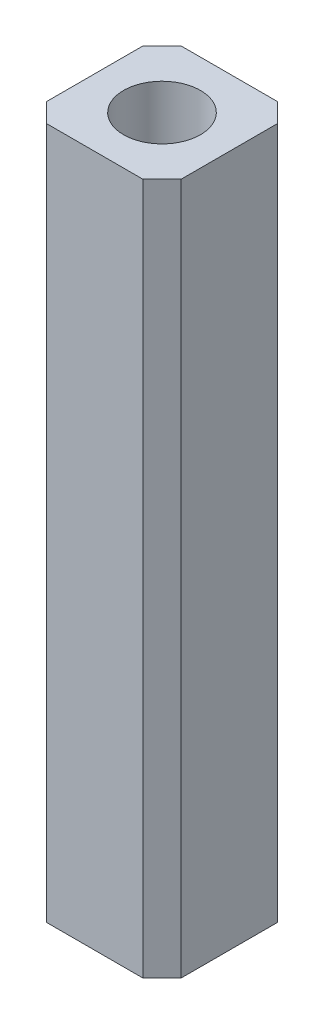
ISO-10303-21;
HEADER;
FILE_DESCRIPTION(('STEP AP214'),'2;1');
FILE_NAME('part.step','',(''),(''),'','','');
FILE_SCHEMA(('AUTOMOTIVE_DESIGN { 1 0 10303 214 1 1 1 1 }'));
ENDSEC;
DATA;
#1=APPLICATION_CONTEXT('core data for automotive mechanical design processes');
#2=APPLICATION_PROTOCOL_DEFINITION('international standard','automotive_design',2000,#1);
#3=PRODUCT_CONTEXT('',#1,'mechanical');
#4=PRODUCT('Part','Part','',(#3));
#5=PRODUCT_RELATED_PRODUCT_CATEGORY('part','',(#4));
#6=PRODUCT_DEFINITION_FORMATION('','',#4);
#7=PRODUCT_DEFINITION_CONTEXT('part definition',#1,'design');
#8=PRODUCT_DEFINITION('design','',#6,#7);
#9=PRODUCT_DEFINITION_SHAPE('','',#8);
#10=(LENGTH_UNIT() NAMED_UNIT(*) SI_UNIT(.MILLI.,.METRE.));
#11=(NAMED_UNIT(*) PLANE_ANGLE_UNIT() SI_UNIT($,.RADIAN.));
#12=(NAMED_UNIT(*) SI_UNIT($,.STERADIAN.) SOLID_ANGLE_UNIT());
#13=UNCERTAINTY_MEASURE_WITH_UNIT(LENGTH_MEASURE(1.E-05),#10,'distance_accuracy_value','');
#14=(GEOMETRIC_REPRESENTATION_CONTEXT(3) GLOBAL_UNCERTAINTY_ASSIGNED_CONTEXT((#13)) GLOBAL_UNIT_ASSIGNED_CONTEXT((#10,
#11,#12)) REPRESENTATION_CONTEXT('',''));
#15=CARTESIAN_POINT('',(0.,0.,0.));
#16=DIRECTION('',(0.,0.,1.));
#17=DIRECTION('',(1.,0.,0.));
#18=AXIS2_PLACEMENT_3D('',#15,#16,#17);
#19=CARTESIAN_POINT('',(0.,18.,0.));
#20=DIRECTION('',(0.,-1.,0.));
#21=DIRECTION('',(0.,0.,-1.));
#22=AXIS2_PLACEMENT_3D('',#19,#20,#21);
#23=PLANE('',#22);
#24=DIRECTION('',(0.,0.,-1.));
#25=VECTOR('',#24,1.);
#26=CARTESIAN_POINT('',(1.75,18.,1.75));
#27=LINE('',#26,#25);
#28=CARTESIAN_POINT('',(1.75,18.,1.25));
#29=VERTEX_POINT('',#28);
#30=CARTESIAN_POINT('',(1.75,18.,-1.25));
#31=VERTEX_POINT('',#30);
#32=EDGE_CURVE('E156',#29,#31,#27,.T.);
#33=ORIENTED_EDGE('',*,*,#32,.T.);
#34=DIRECTION('',(0.707106781186548,0.,0.707106781186548));
#35=VECTOR('',#34,1.);
#36=CARTESIAN_POINT('',(1.25,18.,-1.75));
#37=LINE('',#36,#35);
#38=CARTESIAN_POINT('',(1.25,18.,-1.75));
#39=VERTEX_POINT('',#38);
#40=EDGE_CURVE('E180',#31,#39,#37,.F.);
#41=ORIENTED_EDGE('',*,*,#40,.T.);
#42=DIRECTION('',(-1.,0.,0.));
#43=VECTOR('',#42,1.);
#44=CARTESIAN_POINT('',(-1.75,18.,-1.75));
#45=LINE('',#44,#43);
#46=CARTESIAN_POINT('',(-1.25,18.,-1.75));
#47=VERTEX_POINT('',#46);
#48=EDGE_CURVE('E133',#39,#47,#45,.T.);
#49=ORIENTED_EDGE('',*,*,#48,.T.);
#50=DIRECTION('',(0.707106781186548,0.,-0.707106781186548));
#51=VECTOR('',#50,1.);
#52=CARTESIAN_POINT('',(-1.75,18.,-1.25));
#53=LINE('',#52,#51);
#54=CARTESIAN_POINT('',(-1.75,18.,-1.25));
#55=VERTEX_POINT('',#54);
#56=EDGE_CURVE('E177',#47,#55,#53,.F.);
#57=ORIENTED_EDGE('',*,*,#56,.T.);
#58=DIRECTION('',(0.,0.,1.));
#59=VECTOR('',#58,1.);
#60=CARTESIAN_POINT('',(-1.75,18.,1.75));
#61=LINE('',#60,#59);
#62=CARTESIAN_POINT('',(-1.75,18.,1.25));
#63=VERTEX_POINT('',#62);
#64=EDGE_CURVE('E206',#55,#63,#61,.T.);
#65=ORIENTED_EDGE('',*,*,#64,.T.);
#66=DIRECTION('',(-0.707106781186548,0.,-0.707106781186548));
#67=VECTOR('',#66,1.);
#68=CARTESIAN_POINT('',(-1.25,18.,1.75));
#69=LINE('',#68,#67);
#70=CARTESIAN_POINT('',(-1.25,18.,1.75));
#71=VERTEX_POINT('',#70);
#72=EDGE_CURVE('E67',#63,#71,#69,.F.);
#73=ORIENTED_EDGE('',*,*,#72,.T.);
#74=DIRECTION('',(1.,0.,0.));
#75=VECTOR('',#74,1.);
#76=CARTESIAN_POINT('',(-1.75,18.,1.75));
#77=LINE('',#76,#75);
#78=CARTESIAN_POINT('',(1.25,18.,1.75));
#79=VERTEX_POINT('',#78);
#80=EDGE_CURVE('E158',#71,#79,#77,.T.);
#81=ORIENTED_EDGE('',*,*,#80,.T.);
#82=DIRECTION('',(-0.707106781186548,0.,0.707106781186548));
#83=VECTOR('',#82,1.);
#84=CARTESIAN_POINT('',(1.75,18.,1.25));
#85=LINE('',#84,#83);
#86=EDGE_CURVE('E174',#79,#29,#85,.F.);
#87=ORIENTED_EDGE('',*,*,#86,.T.);
#88=EDGE_LOOP('',(#33,#41,#49,#57,#65,#73,#81,#87));
#89=FACE_BOUND('',#88,.T.);
#90=CARTESIAN_POINT('',(0.,18.,0.));
#91=DIRECTION('',(0.,1.,0.));
#92=DIRECTION('',(0.,0.,1.));
#93=AXIS2_PLACEMENT_3D('',#90,#91,#92);
#94=CIRCLE('',#93,1.);
#95=CARTESIAN_POINT('',(0.,18.,1.));
#96=VERTEX_POINT('',#95);
#97=EDGE_CURVE('E150',#96,#96,#94,.T.);
#98=ORIENTED_EDGE('',*,*,#97,.F.);
#99=EDGE_LOOP('',(#98));
#100=FACE_BOUND('',#99,.T.);
#101=ADVANCED_FACE('F45',(#89,#100),#23,.F.);
#102=CARTESIAN_POINT('',(0.,0.,0.));
#103=DIRECTION('',(0.,-1.,0.));
#104=DIRECTION('',(0.,0.,-1.));
#105=AXIS2_PLACEMENT_3D('',#102,#103,#104);
#106=PLANE('',#105);
#107=DIRECTION('',(-1.,0.,0.));
#108=VECTOR('',#107,1.);
#109=CARTESIAN_POINT('',(-1.75,0.,-1.75));
#110=LINE('',#109,#108);
#111=CARTESIAN_POINT('',(1.25,0.,-1.75));
#112=VERTEX_POINT('',#111);
#113=CARTESIAN_POINT('',(-1.25,0.,-1.75));
#114=VERTEX_POINT('',#113);
#115=EDGE_CURVE('E130',#112,#114,#110,.T.);
#116=ORIENTED_EDGE('',*,*,#115,.F.);
#117=DIRECTION('',(-0.707106781186548,0.,-0.707106781186548));
#118=VECTOR('',#117,1.);
#119=CARTESIAN_POINT('',(1.5,0.,-1.5));
#120=LINE('',#119,#118);
#121=CARTESIAN_POINT('',(1.75,0.,-1.25));
#122=VERTEX_POINT('',#121);
#123=EDGE_CURVE('E112',#112,#122,#120,.F.);
#124=ORIENTED_EDGE('',*,*,#123,.T.);
#125=DIRECTION('',(0.,0.,-1.));
#126=VECTOR('',#125,1.);
#127=CARTESIAN_POINT('',(1.75,0.,1.75));
#128=LINE('',#127,#126);
#129=CARTESIAN_POINT('',(1.75,0.,1.25));
#130=VERTEX_POINT('',#129);
#131=EDGE_CURVE('E143',#130,#122,#128,.T.);
#132=ORIENTED_EDGE('',*,*,#131,.F.);
#133=DIRECTION('',(0.707106781186548,0.,-0.707106781186548));
#134=VECTOR('',#133,1.);
#135=CARTESIAN_POINT('',(1.5,0.,1.5));
#136=LINE('',#135,#134);
#137=CARTESIAN_POINT('',(1.25,0.,1.75));
#138=VERTEX_POINT('',#137);
#139=EDGE_CURVE('E162',#130,#138,#136,.F.);
#140=ORIENTED_EDGE('',*,*,#139,.T.);
#141=DIRECTION('',(1.,0.,0.));
#142=VECTOR('',#141,1.);
#143=CARTESIAN_POINT('',(-1.75,0.,1.75));
#144=LINE('',#143,#142);
#145=CARTESIAN_POINT('',(-1.25,0.,1.75));
#146=VERTEX_POINT('',#145);
#147=EDGE_CURVE('E148',#146,#138,#144,.T.);
#148=ORIENTED_EDGE('',*,*,#147,.F.);
#149=DIRECTION('',(0.707106781186548,0.,0.707106781186548));
#150=VECTOR('',#149,1.);
#151=CARTESIAN_POINT('',(-1.5,0.,1.5));
#152=LINE('',#151,#150);
#153=CARTESIAN_POINT('',(-1.75,0.,1.25));
#154=VERTEX_POINT('',#153);
#155=EDGE_CURVE('E135',#146,#154,#152,.F.);
#156=ORIENTED_EDGE('',*,*,#155,.T.);
#157=DIRECTION('',(0.,0.,1.));
#158=VECTOR('',#157,1.);
#159=CARTESIAN_POINT('',(-1.75,0.,1.75));
#160=LINE('',#159,#158);
#161=CARTESIAN_POINT('',(-1.75,0.,-1.25));
#162=VERTEX_POINT('',#161);
#163=EDGE_CURVE('E142',#162,#154,#160,.T.);
#164=ORIENTED_EDGE('',*,*,#163,.F.);
#165=DIRECTION('',(-0.707106781186548,0.,0.707106781186548));
#166=VECTOR('',#165,1.);
#167=CARTESIAN_POINT('',(-1.5,0.,-1.5));
#168=LINE('',#167,#166);
#169=EDGE_CURVE('E124',#162,#114,#168,.F.);
#170=ORIENTED_EDGE('',*,*,#169,.T.);
#171=EDGE_LOOP('',(#116,#124,#132,#140,#148,#156,#164,#170));
#172=FACE_BOUND('',#171,.T.);
#173=CARTESIAN_POINT('',(0.,0.,0.));
#174=DIRECTION('',(0.,1.,0.));
#175=DIRECTION('',(0.,0.,1.));
#176=AXIS2_PLACEMENT_3D('',#173,#174,#175);
#177=CIRCLE('',#176,1.);
#178=CARTESIAN_POINT('',(0.,0.,1.));
#179=VERTEX_POINT('',#178);
#180=EDGE_CURVE('E209',#179,#179,#177,.T.);
#181=ORIENTED_EDGE('',*,*,#180,.T.);
#182=EDGE_LOOP('',(#181));
#183=FACE_BOUND('',#182,.T.);
#184=ADVANCED_FACE('F138',(#172,#183),#106,.T.);
#185=CARTESIAN_POINT('',(1.75,18.,1.75));
#186=DIRECTION('',(-1.,0.,0.));
#187=DIRECTION('',(0.,0.,1.));
#188=AXIS2_PLACEMENT_3D('',#185,#186,#187);
#189=PLANE('',#188);
#190=ORIENTED_EDGE('',*,*,#131,.T.);
#191=DIRECTION('',(0.,1.,0.));
#192=VECTOR('',#191,1.);
#193=CARTESIAN_POINT('',(1.75,18.,-1.25));
#194=LINE('',#193,#192);
#195=EDGE_CURVE('E117',#122,#31,#194,.T.);
#196=ORIENTED_EDGE('',*,*,#195,.T.);
#197=ORIENTED_EDGE('',*,*,#32,.F.);
#198=DIRECTION('',(0.,-1.,0.));
#199=VECTOR('',#198,1.);
#200=CARTESIAN_POINT('',(1.75,18.,1.25));
#201=LINE('',#200,#199);
#202=EDGE_CURVE('E123',#29,#130,#201,.T.);
#203=ORIENTED_EDGE('',*,*,#202,.T.);
#204=EDGE_LOOP('',(#190,#196,#197,#203));
#205=FACE_BOUND('',#204,.T.);
#206=ADVANCED_FACE('F201',(#205),#189,.F.);
#207=CARTESIAN_POINT('',(-1.75,18.,-1.75));
#208=DIRECTION('',(0.,0.,1.));
#209=DIRECTION('',(1.,0.,0.));
#210=AXIS2_PLACEMENT_3D('',#207,#208,#209);
#211=PLANE('',#210);
#212=ORIENTED_EDGE('',*,*,#48,.F.);
#213=DIRECTION('',(0.,-1.,0.));
#214=VECTOR('',#213,1.);
#215=CARTESIAN_POINT('',(1.25,18.,-1.75));
#216=LINE('',#215,#214);
#217=EDGE_CURVE('E116',#39,#112,#216,.T.);
#218=ORIENTED_EDGE('',*,*,#217,.T.);
#219=ORIENTED_EDGE('',*,*,#115,.T.);
#220=DIRECTION('',(0.,1.,0.));
#221=VECTOR('',#220,1.);
#222=CARTESIAN_POINT('',(-1.25,18.,-1.75));
#223=LINE('',#222,#221);
#224=EDGE_CURVE('E136',#114,#47,#223,.T.);
#225=ORIENTED_EDGE('',*,*,#224,.T.);
#226=EDGE_LOOP('',(#212,#218,#219,#225));
#227=FACE_BOUND('',#226,.T.);
#228=ADVANCED_FACE('F129',(#227),#211,.F.);
#229=CARTESIAN_POINT('',(-1.75,18.,1.75));
#230=DIRECTION('',(1.,0.,0.));
#231=DIRECTION('',(0.,0.,-1.));
#232=AXIS2_PLACEMENT_3D('',#229,#230,#231);
#233=PLANE('',#232);
#234=ORIENTED_EDGE('',*,*,#64,.F.);
#235=DIRECTION('',(0.,-1.,0.));
#236=VECTOR('',#235,1.);
#237=CARTESIAN_POINT('',(-1.75,18.,-1.25));
#238=LINE('',#237,#236);
#239=EDGE_CURVE('E186',#55,#162,#238,.T.);
#240=ORIENTED_EDGE('',*,*,#239,.T.);
#241=ORIENTED_EDGE('',*,*,#163,.T.);
#242=DIRECTION('',(0.,1.,0.));
#243=VECTOR('',#242,1.);
#244=CARTESIAN_POINT('',(-1.75,18.,1.25));
#245=LINE('',#244,#243);
#246=EDGE_CURVE('E183',#154,#63,#245,.T.);
#247=ORIENTED_EDGE('',*,*,#246,.T.);
#248=EDGE_LOOP('',(#234,#240,#241,#247));
#249=FACE_BOUND('',#248,.T.);
#250=ADVANCED_FACE('F234',(#249),#233,.F.);
#251=CARTESIAN_POINT('',(-1.75,18.,1.75));
#252=DIRECTION('',(0.,0.,-1.));
#253=DIRECTION('',(-1.,0.,0.));
#254=AXIS2_PLACEMENT_3D('',#251,#252,#253);
#255=PLANE('',#254);
#256=ORIENTED_EDGE('',*,*,#147,.T.);
#257=DIRECTION('',(0.,1.,0.));
#258=VECTOR('',#257,1.);
#259=CARTESIAN_POINT('',(1.25,18.,1.75));
#260=LINE('',#259,#258);
#261=EDGE_CURVE('E11',#138,#79,#260,.T.);
#262=ORIENTED_EDGE('',*,*,#261,.T.);
#263=ORIENTED_EDGE('',*,*,#80,.F.);
#264=DIRECTION('',(0.,-1.,0.));
#265=VECTOR('',#264,1.);
#266=CARTESIAN_POINT('',(-1.25,18.,1.75));
#267=LINE('',#266,#265);
#268=EDGE_CURVE('E55',#71,#146,#267,.T.);
#269=ORIENTED_EDGE('',*,*,#268,.T.);
#270=EDGE_LOOP('',(#256,#262,#263,#269));
#271=FACE_BOUND('',#270,.T.);
#272=ADVANCED_FACE('F193',(#271),#255,.F.);
#273=CARTESIAN_POINT('',(0.,18.,0.));
#274=DIRECTION('',(0.,-1.,0.));
#275=DIRECTION('',(0.,0.,-1.));
#276=AXIS2_PLACEMENT_3D('',#273,#274,#275);
#277=CYLINDRICAL_SURFACE('',#276,1.);
#278=ORIENTED_EDGE('',*,*,#97,.T.);
#279=EDGE_LOOP('',(#278));
#280=FACE_BOUND('',#279,.T.);
#281=ORIENTED_EDGE('',*,*,#180,.F.);
#282=EDGE_LOOP('',(#281));
#283=FACE_BOUND('',#282,.T.);
#284=ADVANCED_FACE('F225',(#280,#283),#277,.F.);
#285=CARTESIAN_POINT('',(1.25,18.,-1.75));
#286=DIRECTION('',(-0.707106781186547,0.,0.707106781186547));
#287=DIRECTION('',(0.,-1.,0.));
#288=AXIS2_PLACEMENT_3D('',#285,#286,#287);
#289=PLANE('',#288);
#290=ORIENTED_EDGE('',*,*,#40,.F.);
#291=ORIENTED_EDGE('',*,*,#195,.F.);
#292=ORIENTED_EDGE('',*,*,#123,.F.);
#293=ORIENTED_EDGE('',*,*,#217,.F.);
#294=EDGE_LOOP('',(#290,#291,#292,#293));
#295=FACE_BOUND('',#294,.T.);
#296=ADVANCED_FACE('F115',(#295),#289,.F.);
#297=CARTESIAN_POINT('',(-1.75,18.,-1.25));
#298=DIRECTION('',(0.707106781186547,0.,0.707106781186547));
#299=DIRECTION('',(0.,-1.,0.));
#300=AXIS2_PLACEMENT_3D('',#297,#298,#299);
#301=PLANE('',#300);
#302=ORIENTED_EDGE('',*,*,#56,.F.);
#303=ORIENTED_EDGE('',*,*,#224,.F.);
#304=ORIENTED_EDGE('',*,*,#169,.F.);
#305=ORIENTED_EDGE('',*,*,#239,.F.);
#306=EDGE_LOOP('',(#302,#303,#304,#305));
#307=FACE_BOUND('',#306,.T.);
#308=ADVANCED_FACE('F232',(#307),#301,.F.);
#309=CARTESIAN_POINT('',(1.75,18.,1.25));
#310=DIRECTION('',(-0.707106781186547,0.,-0.707106781186547));
#311=DIRECTION('',(0.,-1.,0.));
#312=AXIS2_PLACEMENT_3D('',#309,#310,#311);
#313=PLANE('',#312);
#314=ORIENTED_EDGE('',*,*,#86,.F.);
#315=ORIENTED_EDGE('',*,*,#261,.F.);
#316=ORIENTED_EDGE('',*,*,#139,.F.);
#317=ORIENTED_EDGE('',*,*,#202,.F.);
#318=EDGE_LOOP('',(#314,#315,#316,#317));
#319=FACE_BOUND('',#318,.T.);
#320=ADVANCED_FACE('F198',(#319),#313,.F.);
#321=CARTESIAN_POINT('',(-1.25,18.,1.75));
#322=DIRECTION('',(0.707106781186547,0.,-0.707106781186547));
#323=DIRECTION('',(0.,-1.,0.));
#324=AXIS2_PLACEMENT_3D('',#321,#322,#323);
#325=PLANE('',#324);
#326=ORIENTED_EDGE('',*,*,#72,.F.);
#327=ORIENTED_EDGE('',*,*,#246,.F.);
#328=ORIENTED_EDGE('',*,*,#155,.F.);
#329=ORIENTED_EDGE('',*,*,#268,.F.);
#330=EDGE_LOOP('',(#326,#327,#328,#329));
#331=FACE_BOUND('',#330,.T.);
#332=ADVANCED_FACE('F48',(#331),#325,.F.);
#333=CLOSED_SHELL('',(#101,#184,#206,#228,#250,#272,#284,#296,#308,#320,#332));
#334=MANIFOLD_SOLID_BREP('B2',#333);
#335=ADVANCED_BREP_SHAPE_REPRESENTATION('',(#18,#334),#14);
#336=SHAPE_DEFINITION_REPRESENTATION(#9,#335);
ENDSEC;
END-ISO-10303-21;
